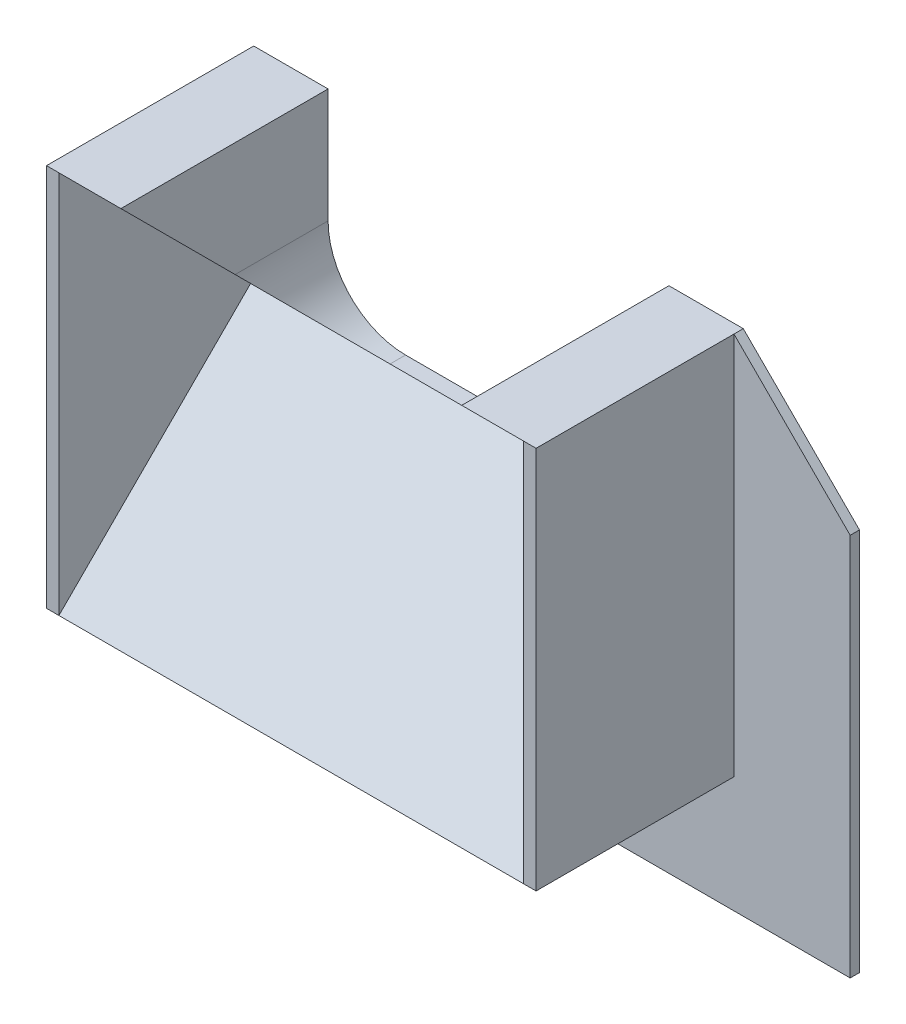
ISO-10303-21;
HEADER;
FILE_DESCRIPTION(('STEP AP214'),'2;1');
FILE_NAME('part.step','',(''),(''),'','','');
FILE_SCHEMA(('AUTOMOTIVE_DESIGN { 1 0 10303 214 1 1 1 1 }'));
ENDSEC;
DATA;
#1=APPLICATION_CONTEXT('core data for automotive mechanical design processes');
#2=APPLICATION_PROTOCOL_DEFINITION('international standard','automotive_design',2000,#1);
#3=PRODUCT_CONTEXT('',#1,'mechanical');
#4=PRODUCT('Part','Part','',(#3));
#5=PRODUCT_RELATED_PRODUCT_CATEGORY('part','',(#4));
#6=PRODUCT_DEFINITION_FORMATION('','',#4);
#7=PRODUCT_DEFINITION_CONTEXT('part definition',#1,'design');
#8=PRODUCT_DEFINITION('design','',#6,#7);
#9=PRODUCT_DEFINITION_SHAPE('','',#8);
#10=(LENGTH_UNIT() NAMED_UNIT(*) SI_UNIT(.MILLI.,.METRE.));
#11=(NAMED_UNIT(*) PLANE_ANGLE_UNIT() SI_UNIT($,.RADIAN.));
#12=(NAMED_UNIT(*) SI_UNIT($,.STERADIAN.) SOLID_ANGLE_UNIT());
#13=UNCERTAINTY_MEASURE_WITH_UNIT(LENGTH_MEASURE(1.E-05),#10,'distance_accuracy_value','');
#14=(GEOMETRIC_REPRESENTATION_CONTEXT(3) GLOBAL_UNCERTAINTY_ASSIGNED_CONTEXT((#13)) GLOBAL_UNIT_ASSIGNED_CONTEXT((#10,
#11,#12)) REPRESENTATION_CONTEXT('',''));
#15=CARTESIAN_POINT('',(0.,0.,0.));
#16=DIRECTION('',(0.,0.,1.));
#17=DIRECTION('',(1.,0.,0.));
#18=AXIS2_PLACEMENT_3D('',#15,#16,#17);
#19=CARTESIAN_POINT('',(60.,-24.7487373415292,24.7487373415292));
#20=DIRECTION('',(0.,1.,0.));
#21=DIRECTION('',(0.,0.,1.));
#22=AXIS2_PLACEMENT_3D('',#19,#20,#21);
#23=PLANE('',#22);
#24=DIRECTION('',(1.,0.,0.));
#25=VECTOR('',#24,1.);
#26=CARTESIAN_POINT('',(61.6,-24.7487373415292,-0.800000000000002));
#27=LINE('',#26,#25);
#28=CARTESIAN_POINT('',(-1.6,-24.7487373415292,-0.800000000000002));
#29=VERTEX_POINT('',#28);
#30=CARTESIAN_POINT('',(61.6,-24.7487373415292,-0.800000000000002));
#31=VERTEX_POINT('',#30);
#32=EDGE_CURVE('E176',#29,#31,#27,.T.);
#33=ORIENTED_EDGE('',*,*,#32,.T.);
#34=DIRECTION('',(0.,0.,1.));
#35=VECTOR('',#34,1.);
#36=CARTESIAN_POINT('',(61.6,-24.7487373415292,24.7487373415292));
#37=LINE('',#36,#35);
#38=CARTESIAN_POINT('',(61.6,-24.7487373415292,24.7487373415292));
#39=VERTEX_POINT('',#38);
#40=EDGE_CURVE('E359',#31,#39,#37,.T.);
#41=ORIENTED_EDGE('',*,*,#40,.T.);
#42=DIRECTION('',(-1.,0.,0.));
#43=VECTOR('',#42,1.);
#44=CARTESIAN_POINT('',(61.6,-24.7487373415292,24.7487373415292));
#45=LINE('',#44,#43);
#46=CARTESIAN_POINT('',(60.,-24.7487373415292,24.7487373415292));
#47=VERTEX_POINT('',#46);
#48=EDGE_CURVE('E216',#39,#47,#45,.T.);
#49=ORIENTED_EDGE('',*,*,#48,.T.);
#50=DIRECTION('',(-1.,0.,0.));
#51=VECTOR('',#50,1.);
#52=CARTESIAN_POINT('',(60.,-24.7487373415292,24.7487373415292));
#53=LINE('',#52,#51);
#54=CARTESIAN_POINT('',(0.,-24.7487373415292,24.7487373415292));
#55=VERTEX_POINT('',#54);
#56=EDGE_CURVE('E266',#47,#55,#53,.T.);
#57=ORIENTED_EDGE('',*,*,#56,.T.);
#58=DIRECTION('',(1.,0.,0.));
#59=VECTOR('',#58,1.);
#60=CARTESIAN_POINT('',(-1.6,-24.7487373415292,24.7487373415292));
#61=LINE('',#60,#59);
#62=CARTESIAN_POINT('',(-1.6,-24.7487373415292,24.7487373415292));
#63=VERTEX_POINT('',#62);
#64=EDGE_CURVE('E201',#63,#55,#61,.T.);
#65=ORIENTED_EDGE('',*,*,#64,.F.);
#66=DIRECTION('',(0.,0.,1.));
#67=VECTOR('',#66,1.);
#68=CARTESIAN_POINT('',(-1.6,-24.7487373415292,24.7487373415292));
#69=LINE('',#68,#67);
#70=EDGE_CURVE('E194',#29,#63,#69,.T.);
#71=ORIENTED_EDGE('',*,*,#70,.F.);
#72=EDGE_LOOP('',(#33,#41,#49,#57,#65,#71));
#73=FACE_BOUND('',#72,.T.);
#74=ADVANCED_FACE('F39',(#73),#23,.F.);
#75=CARTESIAN_POINT('',(-1.6,0.,0.));
#76=DIRECTION('',(1.,0.,0.));
#77=DIRECTION('',(0.,0.,-1.));
#78=AXIS2_PLACEMENT_3D('',#75,#76,#77);
#79=PLANE('',#78);
#80=DIRECTION('',(0.,-1.,0.));
#81=VECTOR('',#80,1.);
#82=CARTESIAN_POINT('',(-1.6,-24.7487373415292,-0.800000000000002));
#83=LINE('',#82,#81);
#84=CARTESIAN_POINT('',(-1.6,24.7487373415292,-0.800000000000002));
#85=VERTEX_POINT('',#84);
#86=EDGE_CURVE('E180',#85,#29,#83,.T.);
#87=ORIENTED_EDGE('',*,*,#86,.T.);
#88=ORIENTED_EDGE('',*,*,#70,.T.);
#89=DIRECTION('',(0.,1.,0.));
#90=VECTOR('',#89,1.);
#91=CARTESIAN_POINT('',(-1.6,24.7487373415292,24.7487373415292));
#92=LINE('',#91,#90);
#93=CARTESIAN_POINT('',(-1.6,24.7487373415292,24.7487373415292));
#94=VERTEX_POINT('',#93);
#95=EDGE_CURVE('E209',#63,#94,#92,.T.);
#96=ORIENTED_EDGE('',*,*,#95,.T.);
#97=DIRECTION('',(0.,0.,-1.));
#98=VECTOR('',#97,1.);
#99=CARTESIAN_POINT('',(-1.6,24.7487373415292,24.7487373415292));
#100=LINE('',#99,#98);
#101=EDGE_CURVE('E196',#94,#85,#100,.T.);
#102=ORIENTED_EDGE('',*,*,#101,.T.);
#103=EDGE_LOOP('',(#87,#88,#96,#102));
#104=FACE_BOUND('',#103,.T.);
#105=ADVANCED_FACE('F192',(#104),#79,.F.);
#106=CARTESIAN_POINT('',(61.6,0.,0.));
#107=DIRECTION('',(-1.,0.,0.));
#108=DIRECTION('',(0.,0.,-1.));
#109=AXIS2_PLACEMENT_3D('',#106,#107,#108);
#110=PLANE('',#109);
#111=DIRECTION('',(0.,1.,0.));
#112=VECTOR('',#111,1.);
#113=CARTESIAN_POINT('',(61.6,24.7487373415292,-0.800000000000002));
#114=LINE('',#113,#112);
#115=CARTESIAN_POINT('',(61.6,24.7487373415292,-0.800000000000002));
#116=VERTEX_POINT('',#115);
#117=EDGE_CURVE('E184',#31,#116,#114,.T.);
#118=ORIENTED_EDGE('',*,*,#117,.T.);
#119=DIRECTION('',(0.,0.,-1.));
#120=VECTOR('',#119,1.);
#121=CARTESIAN_POINT('',(61.6,24.7487373415292,24.7487373415292));
#122=LINE('',#121,#120);
#123=CARTESIAN_POINT('',(61.6,24.7487373415292,24.7487373415292));
#124=VERTEX_POINT('',#123);
#125=EDGE_CURVE('E362',#124,#116,#122,.T.);
#126=ORIENTED_EDGE('',*,*,#125,.F.);
#127=DIRECTION('',(0.,1.,0.));
#128=VECTOR('',#127,1.);
#129=CARTESIAN_POINT('',(61.6,24.7487373415292,24.7487373415292));
#130=LINE('',#129,#128);
#131=EDGE_CURVE('E355',#39,#124,#130,.T.);
#132=ORIENTED_EDGE('',*,*,#131,.F.);
#133=ORIENTED_EDGE('',*,*,#40,.F.);
#134=EDGE_LOOP('',(#118,#126,#132,#133));
#135=FACE_BOUND('',#134,.T.);
#136=ADVANCED_FACE('F413',(#135),#110,.F.);
#137=CARTESIAN_POINT('',(60.,24.7487373415292,-2.));
#138=DIRECTION('',(0.,-1.,0.));
#139=DIRECTION('',(0.,0.,-1.));
#140=AXIS2_PLACEMENT_3D('',#137,#138,#139);
#141=PLANE('',#140);
#142=DIRECTION('',(-1.,0.,0.));
#143=VECTOR('',#142,1.);
#144=CARTESIAN_POINT('',(60.,24.7487373415292,24.7487373415292));
#145=LINE('',#144,#143);
#146=CARTESIAN_POINT('',(8.,24.7487373415292,24.7487373415292));
#147=VERTEX_POINT('',#146);
#148=CARTESIAN_POINT('',(0.,24.7487373415292,24.7487373415292));
#149=VERTEX_POINT('',#148);
#150=EDGE_CURVE('E271',#147,#149,#145,.T.);
#151=ORIENTED_EDGE('',*,*,#150,.F.);
#152=DIRECTION('',(0.,0.,-1.));
#153=VECTOR('',#152,1.);
#154=CARTESIAN_POINT('',(8.,24.7487373415292,24.7487373415292));
#155=LINE('',#154,#153);
#156=CARTESIAN_POINT('',(8.,24.7487373415292,-2.));
#157=VERTEX_POINT('',#156);
#158=EDGE_CURVE('E230',#147,#157,#155,.T.);
#159=ORIENTED_EDGE('',*,*,#158,.T.);
#160=DIRECTION('',(-1.,0.,0.));
#161=VECTOR('',#160,1.);
#162=CARTESIAN_POINT('',(60.,24.7487373415292,-2.));
#163=LINE('',#162,#161);
#164=CARTESIAN_POINT('',(-1.6,24.7487373415292,-2.));
#165=VERTEX_POINT('',#164);
#166=EDGE_CURVE('E256',#157,#165,#163,.T.);
#167=ORIENTED_EDGE('',*,*,#166,.T.);
#168=DIRECTION('',(0.,0.,-1.));
#169=VECTOR('',#168,1.);
#170=CARTESIAN_POINT('',(-1.6,24.7487373415292,-0.800000000000002));
#171=LINE('',#170,#169);
#172=EDGE_CURVE('E337',#85,#165,#171,.T.);
#173=ORIENTED_EDGE('',*,*,#172,.F.);
#174=ORIENTED_EDGE('',*,*,#101,.F.);
#175=DIRECTION('',(1.,0.,0.));
#176=VECTOR('',#175,1.);
#177=CARTESIAN_POINT('',(-1.6,24.7487373415292,24.7487373415292));
#178=LINE('',#177,#176);
#179=EDGE_CURVE('E207',#94,#149,#178,.T.);
#180=ORIENTED_EDGE('',*,*,#179,.T.);
#181=EDGE_LOOP('',(#151,#159,#167,#173,#174,#180));
#182=FACE_BOUND('',#181,.T.);
#183=ADVANCED_FACE('F381',(#182),#141,.F.);
#184=CARTESIAN_POINT('',(60.,24.7487373415292,24.7487373415292));
#185=DIRECTION('',(0.,0.707106781186548,-0.707106781186547));
#186=DIRECTION('',(0.,0.707106781186547,0.707106781186548));
#187=AXIS2_PLACEMENT_3D('',#184,#185,#186);
#188=PLANE('',#187);
#189=DIRECTION('',(-1.,0.,0.));
#190=VECTOR('',#189,1.);
#191=CARTESIAN_POINT('',(60.,0.,0.));
#192=LINE('',#191,#190);
#193=CARTESIAN_POINT('',(18.,0.,0.));
#194=VERTEX_POINT('',#193);
#195=CARTESIAN_POINT('',(0.,0.,0.));
#196=VERTEX_POINT('',#195);
#197=EDGE_CURVE('E76',#194,#196,#192,.T.);
#198=ORIENTED_EDGE('',*,*,#197,.F.);
#199=CARTESIAN_POINT('',(18.,9.99999999999999,9.99999999999999));
#200=DIRECTION('',(0.,0.707106781186548,-0.707106781186547));
#201=DIRECTION('',(0.,0.707106781186547,0.707106781186548));
#202=AXIS2_PLACEMENT_3D('',#199,#200,#201);
#203=ELLIPSE('',#202,14.142135623731,10.);
#204=CARTESIAN_POINT('',(8.,9.99999999999999,9.99999999999999));
#205=VERTEX_POINT('',#204);
#206=EDGE_CURVE('E291',#194,#205,#203,.T.);
#207=ORIENTED_EDGE('',*,*,#206,.T.);
#208=DIRECTION('',(0.,0.707106781186547,0.707106781186548));
#209=VECTOR('',#208,1.);
#210=CARTESIAN_POINT('',(8.,24.7487373415292,24.7487373415292));
#211=LINE('',#210,#209);
#212=EDGE_CURVE('E243',#205,#147,#211,.T.);
#213=ORIENTED_EDGE('',*,*,#212,.T.);
#214=ORIENTED_EDGE('',*,*,#150,.T.);
#215=DIRECTION('',(0.,-0.707106781186547,-0.707106781186548));
#216=VECTOR('',#215,1.);
#217=CARTESIAN_POINT('',(0.,24.7487373415292,24.7487373415292));
#218=LINE('',#217,#216);
#219=EDGE_CURVE('E246',#149,#196,#218,.T.);
#220=ORIENTED_EDGE('',*,*,#219,.T.);
#221=EDGE_LOOP('',(#198,#207,#213,#214,#220));
#222=FACE_BOUND('',#221,.T.);
#223=ADVANCED_FACE('F444',(#222),#188,.F.);
#224=CARTESIAN_POINT('',(61.6,24.7487373415292,-2.));
#225=VERTEX_POINT('',#224);
#226=CARTESIAN_POINT('',(52.,24.7487373415292,-2.));
#227=VERTEX_POINT('',#226);
#228=EDGE_CURVE('E262',#225,#227,#163,.T.);
#229=ORIENTED_EDGE('',*,*,#228,.T.);
#230=DIRECTION('',(0.,0.,-1.));
#231=VECTOR('',#230,1.);
#232=CARTESIAN_POINT('',(52.,24.7487373415292,24.7487373415292));
#233=LINE('',#232,#231);
#234=CARTESIAN_POINT('',(52.,24.7487373415292,24.7487373415292));
#235=VERTEX_POINT('',#234);
#236=EDGE_CURVE('E231',#235,#227,#233,.T.);
#237=ORIENTED_EDGE('',*,*,#236,.F.);
#238=CARTESIAN_POINT('',(60.,24.7487373415292,24.7487373415292));
#239=VERTEX_POINT('',#238);
#240=EDGE_CURVE('E272',#239,#235,#145,.T.);
#241=ORIENTED_EDGE('',*,*,#240,.F.);
#242=DIRECTION('',(-1.,0.,0.));
#243=VECTOR('',#242,1.);
#244=CARTESIAN_POINT('',(61.6,24.7487373415292,24.7487373415292));
#245=LINE('',#244,#243);
#246=EDGE_CURVE('E365',#124,#239,#245,.T.);
#247=ORIENTED_EDGE('',*,*,#246,.F.);
#248=ORIENTED_EDGE('',*,*,#125,.T.);
#249=DIRECTION('',(0.,0.,-1.));
#250=VECTOR('',#249,1.);
#251=CARTESIAN_POINT('',(61.6,24.7487373415292,-0.800000000000002));
#252=LINE('',#251,#250);
#253=EDGE_CURVE('E311',#116,#225,#252,.T.);
#254=ORIENTED_EDGE('',*,*,#253,.T.);
#255=EDGE_LOOP('',(#229,#237,#241,#247,#248,#254));
#256=FACE_BOUND('',#255,.T.);
#257=ADVANCED_FACE('F307',(#256),#141,.F.);
#258=ORIENTED_EDGE('',*,*,#240,.T.);
#259=DIRECTION('',(0.,-0.707106781186547,-0.707106781186548));
#260=VECTOR('',#259,1.);
#261=CARTESIAN_POINT('',(52.,24.7487373415292,24.7487373415292));
#262=LINE('',#261,#260);
#263=CARTESIAN_POINT('',(52.,9.99999999999999,9.99999999999999));
#264=VERTEX_POINT('',#263);
#265=EDGE_CURVE('E234',#235,#264,#262,.T.);
#266=ORIENTED_EDGE('',*,*,#265,.T.);
#267=CARTESIAN_POINT('',(42.,9.99999999999999,9.99999999999999));
#268=DIRECTION('',(0.,0.707106781186548,-0.707106781186547));
#269=DIRECTION('',(0.,0.707106781186547,0.707106781186548));
#270=AXIS2_PLACEMENT_3D('',#267,#268,#269);
#271=ELLIPSE('',#270,14.142135623731,10.);
#272=CARTESIAN_POINT('',(42.,0.,0.));
#273=VERTEX_POINT('',#272);
#274=EDGE_CURVE('E11',#264,#273,#271,.T.);
#275=ORIENTED_EDGE('',*,*,#274,.T.);
#276=CARTESIAN_POINT('',(60.,0.,0.));
#277=VERTEX_POINT('',#276);
#278=EDGE_CURVE('E55',#277,#273,#192,.T.);
#279=ORIENTED_EDGE('',*,*,#278,.F.);
#280=DIRECTION('',(0.,-0.707106781186547,-0.707106781186548));
#281=VECTOR('',#280,1.);
#282=CARTESIAN_POINT('',(60.,24.7487373415292,24.7487373415292));
#283=LINE('',#282,#281);
#284=EDGE_CURVE('E247',#239,#277,#283,.T.);
#285=ORIENTED_EDGE('',*,*,#284,.F.);
#286=EDGE_LOOP('',(#258,#266,#275,#279,#285));
#287=FACE_BOUND('',#286,.T.);
#288=ADVANCED_FACE('F304',(#287),#188,.F.);
#289=CARTESIAN_POINT('',(60.,0.,0.));
#290=DIRECTION('',(0.,-0.707106781186548,-0.707106781186547));
#291=DIRECTION('',(0.,0.707106781186547,-0.707106781186548));
#292=AXIS2_PLACEMENT_3D('',#289,#290,#291);
#293=PLANE('',#292);
#294=DIRECTION('',(0.,-0.707106781186547,0.707106781186548));
#295=VECTOR('',#294,1.);
#296=CARTESIAN_POINT('',(0.,0.,0.));
#297=LINE('',#296,#295);
#298=EDGE_CURVE('E252',#196,#55,#297,.T.);
#299=ORIENTED_EDGE('',*,*,#298,.T.);
#300=ORIENTED_EDGE('',*,*,#56,.F.);
#301=DIRECTION('',(0.,-0.707106781186547,0.707106781186548));
#302=VECTOR('',#301,1.);
#303=CARTESIAN_POINT('',(60.,0.,0.));
#304=LINE('',#303,#302);
#305=EDGE_CURVE('E251',#277,#47,#304,.T.);
#306=ORIENTED_EDGE('',*,*,#305,.F.);
#307=ORIENTED_EDGE('',*,*,#278,.T.);
#308=DIRECTION('',(-1.,0.,0.));
#309=VECTOR('',#308,1.);
#310=CARTESIAN_POINT('',(60.,0.,0.));
#311=LINE('',#310,#309);
#312=EDGE_CURVE('E240',#273,#194,#311,.T.);
#313=ORIENTED_EDGE('',*,*,#312,.T.);
#314=ORIENTED_EDGE('',*,*,#197,.T.);
#315=EDGE_LOOP('',(#299,#300,#306,#307,#313,#314));
#316=FACE_BOUND('',#315,.T.);
#317=ADVANCED_FACE('F419',(#316),#293,.F.);
#318=CARTESIAN_POINT('',(60.,-24.7487373415292,-2.));
#319=DIRECTION('',(0.,0.,1.));
#320=DIRECTION('',(1.,0.,0.));
#321=AXIS2_PLACEMENT_3D('',#318,#319,#320);
#322=PLANE('',#321);
#323=ORIENTED_EDGE('',*,*,#166,.F.);
#324=DIRECTION('',(0.,1.,0.));
#325=VECTOR('',#324,1.);
#326=CARTESIAN_POINT('',(8.,0.,-2.));
#327=LINE('',#326,#325);
#328=CARTESIAN_POINT('',(8.,9.99999999999999,-2.));
#329=VERTEX_POINT('',#328);
#330=EDGE_CURVE('E221',#329,#157,#327,.T.);
#331=ORIENTED_EDGE('',*,*,#330,.F.);
#332=CARTESIAN_POINT('',(18.,9.99999999999999,-2.));
#333=DIRECTION('',(0.,0.,1.));
#334=DIRECTION('',(1.,0.,0.));
#335=AXIS2_PLACEMENT_3D('',#332,#333,#334);
#336=CIRCLE('',#335,10.);
#337=CARTESIAN_POINT('',(18.,0.,-2.));
#338=VERTEX_POINT('',#337);
#339=EDGE_CURVE('E84',#329,#338,#336,.T.);
#340=ORIENTED_EDGE('',*,*,#339,.T.);
#341=DIRECTION('',(-1.,0.,0.));
#342=VECTOR('',#341,1.);
#343=CARTESIAN_POINT('',(52.,0.,-2.));
#344=LINE('',#343,#342);
#345=CARTESIAN_POINT('',(42.,0.,-2.));
#346=VERTEX_POINT('',#345);
#347=EDGE_CURVE('E227',#346,#338,#344,.T.);
#348=ORIENTED_EDGE('',*,*,#347,.F.);
#349=CARTESIAN_POINT('',(42.,9.99999999999999,-2.));
#350=DIRECTION('',(0.,0.,1.));
#351=DIRECTION('',(1.,0.,0.));
#352=AXIS2_PLACEMENT_3D('',#349,#350,#351);
#353=CIRCLE('',#352,10.);
#354=CARTESIAN_POINT('',(52.,9.99999999999999,-2.));
#355=VERTEX_POINT('',#354);
#356=EDGE_CURVE('E48',#346,#355,#353,.T.);
#357=ORIENTED_EDGE('',*,*,#356,.T.);
#358=DIRECTION('',(0.,-1.,0.));
#359=VECTOR('',#358,1.);
#360=CARTESIAN_POINT('',(52.,0.,-2.));
#361=LINE('',#360,#359);
#362=EDGE_CURVE('E224',#227,#355,#361,.T.);
#363=ORIENTED_EDGE('',*,*,#362,.F.);
#364=ORIENTED_EDGE('',*,*,#228,.F.);
#365=DIRECTION('',(0.707106781186548,-0.707106781186547,0.));
#366=VECTOR('',#365,1.);
#367=CARTESIAN_POINT('',(76.6,9.74873734152916,-2.));
#368=LINE('',#367,#366);
#369=CARTESIAN_POINT('',(76.6,9.74873734152916,-2.));
#370=VERTEX_POINT('',#369);
#371=EDGE_CURVE('E314',#225,#370,#368,.T.);
#372=ORIENTED_EDGE('',*,*,#371,.T.);
#373=DIRECTION('',(0.,-1.,0.));
#374=VECTOR('',#373,1.);
#375=CARTESIAN_POINT('',(76.6,-39.7487373415292,-2.));
#376=LINE('',#375,#374);
#377=CARTESIAN_POINT('',(76.6,-39.7487373415292,-2.));
#378=VERTEX_POINT('',#377);
#379=EDGE_CURVE('E317',#370,#378,#376,.T.);
#380=ORIENTED_EDGE('',*,*,#379,.T.);
#381=DIRECTION('',(-1.,0.,0.));
#382=VECTOR('',#381,1.);
#383=CARTESIAN_POINT('',(-16.6,-39.7487373415292,-2.));
#384=LINE('',#383,#382);
#385=CARTESIAN_POINT('',(-16.6,-39.7487373415292,-2.));
#386=VERTEX_POINT('',#385);
#387=EDGE_CURVE('E322',#378,#386,#384,.T.);
#388=ORIENTED_EDGE('',*,*,#387,.T.);
#389=DIRECTION('',(0.,1.,0.));
#390=VECTOR('',#389,1.);
#391=CARTESIAN_POINT('',(-16.6,9.74873734152916,-2.));
#392=LINE('',#391,#390);
#393=CARTESIAN_POINT('',(-16.6,9.74873734152916,-2.));
#394=VERTEX_POINT('',#393);
#395=EDGE_CURVE('E330',#386,#394,#392,.T.);
#396=ORIENTED_EDGE('',*,*,#395,.T.);
#397=DIRECTION('',(0.707106781186547,0.707106781186547,0.));
#398=VECTOR('',#397,1.);
#399=CARTESIAN_POINT('',(-1.6,24.7487373415292,-2.));
#400=LINE('',#399,#398);
#401=EDGE_CURVE('E198',#394,#165,#400,.T.);
#402=ORIENTED_EDGE('',*,*,#401,.T.);
#403=EDGE_LOOP('',(#323,#331,#340,#348,#357,#363,#364,#372,#380,#388,#396,#402));
#404=FACE_BOUND('',#403,.T.);
#405=ADVANCED_FACE('F296',(#404),#322,.F.);
#406=CARTESIAN_POINT('',(8.,0.,24.7487373415292));
#407=DIRECTION('',(-1.,0.,0.));
#408=DIRECTION('',(0.,0.,1.));
#409=AXIS2_PLACEMENT_3D('',#406,#407,#408);
#410=PLANE('',#409);
#411=ORIENTED_EDGE('',*,*,#212,.F.);
#412=DIRECTION('',(0.,0.,-1.));
#413=VECTOR('',#412,1.);
#414=CARTESIAN_POINT('',(8.,9.99999999999999,-2.));
#415=LINE('',#414,#413);
#416=EDGE_CURVE('E276',#205,#329,#415,.T.);
#417=ORIENTED_EDGE('',*,*,#416,.T.);
#418=ORIENTED_EDGE('',*,*,#330,.T.);
#419=ORIENTED_EDGE('',*,*,#158,.F.);
#420=EDGE_LOOP('',(#411,#417,#418,#419));
#421=FACE_BOUND('',#420,.T.);
#422=ADVANCED_FACE('F462',(#421),#410,.F.);
#423=CARTESIAN_POINT('',(52.,0.,24.7487373415292));
#424=DIRECTION('',(0.,-1.,0.));
#425=DIRECTION('',(1.,0.,0.));
#426=AXIS2_PLACEMENT_3D('',#423,#424,#425);
#427=PLANE('',#426);
#428=ORIENTED_EDGE('',*,*,#347,.T.);
#429=DIRECTION('',(0.,0.,-1.));
#430=VECTOR('',#429,1.);
#431=CARTESIAN_POINT('',(18.,0.,0.));
#432=LINE('',#431,#430);
#433=EDGE_CURVE('E284',#338,#194,#432,.F.);
#434=ORIENTED_EDGE('',*,*,#433,.T.);
#435=ORIENTED_EDGE('',*,*,#312,.F.);
#436=DIRECTION('',(0.,0.,-1.));
#437=VECTOR('',#436,1.);
#438=CARTESIAN_POINT('',(42.,0.,-2.));
#439=LINE('',#438,#437);
#440=EDGE_CURVE('E280',#273,#346,#439,.T.);
#441=ORIENTED_EDGE('',*,*,#440,.T.);
#442=EDGE_LOOP('',(#428,#434,#435,#441));
#443=FACE_BOUND('',#442,.T.);
#444=ADVANCED_FACE('F454',(#443),#427,.F.);
#445=CARTESIAN_POINT('',(52.,0.,24.7487373415292));
#446=DIRECTION('',(1.,0.,0.));
#447=DIRECTION('',(0.,1.,0.));
#448=AXIS2_PLACEMENT_3D('',#445,#446,#447);
#449=PLANE('',#448);
#450=ORIENTED_EDGE('',*,*,#362,.T.);
#451=DIRECTION('',(0.,0.,-1.));
#452=VECTOR('',#451,1.);
#453=CARTESIAN_POINT('',(52.,9.99999999999999,0.));
#454=LINE('',#453,#452);
#455=EDGE_CURVE('E64',#355,#264,#454,.F.);
#456=ORIENTED_EDGE('',*,*,#455,.T.);
#457=ORIENTED_EDGE('',*,*,#265,.F.);
#458=ORIENTED_EDGE('',*,*,#236,.T.);
#459=EDGE_LOOP('',(#450,#456,#457,#458));
#460=FACE_BOUND('',#459,.T.);
#461=ADVANCED_FACE('F300',(#460),#449,.F.);
#462=CARTESIAN_POINT('',(18.,9.99999999999999,24.7487373415292));
#463=DIRECTION('',(0.,0.,1.));
#464=DIRECTION('',(1.,0.,0.));
#465=AXIS2_PLACEMENT_3D('',#462,#463,#464);
#466=CYLINDRICAL_SURFACE('',#465,10.);
#467=ORIENTED_EDGE('',*,*,#206,.F.);
#468=ORIENTED_EDGE('',*,*,#433,.F.);
#469=ORIENTED_EDGE('',*,*,#339,.F.);
#470=ORIENTED_EDGE('',*,*,#416,.F.);
#471=EDGE_LOOP('',(#467,#468,#469,#470));
#472=FACE_BOUND('',#471,.T.);
#473=ADVANCED_FACE('F446',(#472),#466,.F.);
#474=CARTESIAN_POINT('',(42.,9.99999999999999,24.7487373415292));
#475=DIRECTION('',(0.,0.,1.));
#476=DIRECTION('',(1.,0.,0.));
#477=AXIS2_PLACEMENT_3D('',#474,#475,#476);
#478=CYLINDRICAL_SURFACE('',#477,10.);
#479=ORIENTED_EDGE('',*,*,#274,.F.);
#480=ORIENTED_EDGE('',*,*,#455,.F.);
#481=ORIENTED_EDGE('',*,*,#356,.F.);
#482=ORIENTED_EDGE('',*,*,#440,.F.);
#483=EDGE_LOOP('',(#479,#480,#481,#482));
#484=FACE_BOUND('',#483,.T.);
#485=ADVANCED_FACE('F41',(#484),#478,.F.);
#486=CARTESIAN_POINT('',(0.,0.,0.));
#487=DIRECTION('',(1.,0.,0.));
#488=DIRECTION('',(0.,0.,-1.));
#489=AXIS2_PLACEMENT_3D('',#486,#487,#488);
#490=PLANE('',#489);
#491=ORIENTED_EDGE('',*,*,#298,.F.);
#492=ORIENTED_EDGE('',*,*,#219,.F.);
#493=DIRECTION('',(0.,1.,0.));
#494=VECTOR('',#493,1.);
#495=CARTESIAN_POINT('',(0.,24.7487373415292,24.7487373415292));
#496=LINE('',#495,#494);
#497=EDGE_CURVE('E213',#55,#149,#496,.T.);
#498=ORIENTED_EDGE('',*,*,#497,.F.);
#499=EDGE_LOOP('',(#491,#492,#498));
#500=FACE_BOUND('',#499,.T.);
#501=ADVANCED_FACE('F453',(#500),#490,.T.);
#502=CARTESIAN_POINT('',(-1.6,24.7487373415292,24.7487373415292));
#503=DIRECTION('',(0.,0.,-1.));
#504=DIRECTION('',(-1.,0.,0.));
#505=AXIS2_PLACEMENT_3D('',#502,#503,#504);
#506=PLANE('',#505);
#507=ORIENTED_EDGE('',*,*,#497,.T.);
#508=ORIENTED_EDGE('',*,*,#179,.F.);
#509=ORIENTED_EDGE('',*,*,#95,.F.);
#510=ORIENTED_EDGE('',*,*,#64,.T.);
#511=EDGE_LOOP('',(#507,#508,#509,#510));
#512=FACE_BOUND('',#511,.T.);
#513=ADVANCED_FACE('F376',(#512),#506,.F.);
#514=CARTESIAN_POINT('',(61.6,24.7487373415292,24.7487373415292));
#515=DIRECTION('',(0.,0.,1.));
#516=DIRECTION('',(1.,0.,0.));
#517=AXIS2_PLACEMENT_3D('',#514,#515,#516);
#518=PLANE('',#517);
#519=DIRECTION('',(0.,1.,0.));
#520=VECTOR('',#519,1.);
#521=CARTESIAN_POINT('',(60.,24.7487373415292,24.7487373415292));
#522=LINE('',#521,#520);
#523=EDGE_CURVE('E340',#47,#239,#522,.T.);
#524=ORIENTED_EDGE('',*,*,#523,.F.);
#525=ORIENTED_EDGE('',*,*,#48,.F.);
#526=ORIENTED_EDGE('',*,*,#131,.T.);
#527=ORIENTED_EDGE('',*,*,#246,.T.);
#528=EDGE_LOOP('',(#524,#525,#526,#527));
#529=FACE_BOUND('',#528,.T.);
#530=ADVANCED_FACE('F418',(#529),#518,.T.);
#531=CARTESIAN_POINT('',(60.,0.,0.));
#532=DIRECTION('',(-1.,0.,0.));
#533=DIRECTION('',(0.,0.,-1.));
#534=AXIS2_PLACEMENT_3D('',#531,#532,#533);
#535=PLANE('',#534);
#536=ORIENTED_EDGE('',*,*,#523,.T.);
#537=ORIENTED_EDGE('',*,*,#284,.T.);
#538=ORIENTED_EDGE('',*,*,#305,.T.);
#539=EDGE_LOOP('',(#536,#537,#538));
#540=FACE_BOUND('',#539,.T.);
#541=ADVANCED_FACE('F421',(#540),#535,.T.);
#542=CARTESIAN_POINT('',(-1.6,24.7487373415292,-0.800000000000002));
#543=DIRECTION('',(-0.707106781186547,0.707106781186547,0.));
#544=DIRECTION('',(-0.707106781186548,-0.707106781186548,0.));
#545=AXIS2_PLACEMENT_3D('',#542,#543,#544);
#546=PLANE('',#545);
#547=ORIENTED_EDGE('',*,*,#401,.F.);
#548=DIRECTION('',(0.,0.,-1.));
#549=VECTOR('',#548,1.);
#550=CARTESIAN_POINT('',(-16.6,9.74873734152916,-0.800000000000002));
#551=LINE('',#550,#549);
#552=CARTESIAN_POINT('',(-16.6,9.74873734152916,-0.800000000000002));
#553=VERTEX_POINT('',#552);
#554=EDGE_CURVE('E341',#553,#394,#551,.T.);
#555=ORIENTED_EDGE('',*,*,#554,.F.);
#556=DIRECTION('',(0.707106781186547,0.707106781186547,0.));
#557=VECTOR('',#556,1.);
#558=CARTESIAN_POINT('',(-1.6,24.7487373415292,-0.800000000000002));
#559=LINE('',#558,#557);
#560=EDGE_CURVE('E325',#553,#85,#559,.T.);
#561=ORIENTED_EDGE('',*,*,#560,.T.);
#562=ORIENTED_EDGE('',*,*,#172,.T.);
#563=EDGE_LOOP('',(#547,#555,#561,#562));
#564=FACE_BOUND('',#563,.T.);
#565=ADVANCED_FACE('F386',(#564),#546,.T.);
#566=CARTESIAN_POINT('',(-16.6,9.74873734152916,-0.800000000000002));
#567=DIRECTION('',(-1.,0.,0.));
#568=DIRECTION('',(0.,0.,1.));
#569=AXIS2_PLACEMENT_3D('',#566,#567,#568);
#570=PLANE('',#569);
#571=ORIENTED_EDGE('',*,*,#395,.F.);
#572=DIRECTION('',(0.,0.,-1.));
#573=VECTOR('',#572,1.);
#574=CARTESIAN_POINT('',(-16.6,-39.7487373415292,-0.800000000000002));
#575=LINE('',#574,#573);
#576=CARTESIAN_POINT('',(-16.6,-39.7487373415292,-0.800000000000002));
#577=VERTEX_POINT('',#576);
#578=EDGE_CURVE('E344',#577,#386,#575,.T.);
#579=ORIENTED_EDGE('',*,*,#578,.F.);
#580=DIRECTION('',(0.,1.,0.));
#581=VECTOR('',#580,1.);
#582=CARTESIAN_POINT('',(-16.6,9.74873734152916,-0.800000000000002));
#583=LINE('',#582,#581);
#584=EDGE_CURVE('E393',#577,#553,#583,.T.);
#585=ORIENTED_EDGE('',*,*,#584,.T.);
#586=ORIENTED_EDGE('',*,*,#554,.T.);
#587=EDGE_LOOP('',(#571,#579,#585,#586));
#588=FACE_BOUND('',#587,.T.);
#589=ADVANCED_FACE('F390',(#588),#570,.T.);
#590=CARTESIAN_POINT('',(-16.6,-39.7487373415292,-0.800000000000002));
#591=DIRECTION('',(0.,-1.,0.));
#592=DIRECTION('',(0.,0.,-1.));
#593=AXIS2_PLACEMENT_3D('',#590,#591,#592);
#594=PLANE('',#593);
#595=ORIENTED_EDGE('',*,*,#387,.F.);
#596=DIRECTION('',(0.,0.,-1.));
#597=VECTOR('',#596,1.);
#598=CARTESIAN_POINT('',(76.6,-39.7487373415292,-0.800000000000002));
#599=LINE('',#598,#597);
#600=CARTESIAN_POINT('',(76.6,-39.7487373415292,-0.800000000000002));
#601=VERTEX_POINT('',#600);
#602=EDGE_CURVE('E347',#601,#378,#599,.T.);
#603=ORIENTED_EDGE('',*,*,#602,.F.);
#604=DIRECTION('',(-1.,0.,0.));
#605=VECTOR('',#604,1.);
#606=CARTESIAN_POINT('',(-16.6,-39.7487373415292,-0.800000000000002));
#607=LINE('',#606,#605);
#608=EDGE_CURVE('E397',#601,#577,#607,.T.);
#609=ORIENTED_EDGE('',*,*,#608,.T.);
#610=ORIENTED_EDGE('',*,*,#578,.T.);
#611=EDGE_LOOP('',(#595,#603,#609,#610));
#612=FACE_BOUND('',#611,.T.);
#613=ADVANCED_FACE('F558',(#612),#594,.T.);
#614=CARTESIAN_POINT('',(76.6,-39.7487373415292,-0.800000000000002));
#615=DIRECTION('',(1.,0.,0.));
#616=DIRECTION('',(0.,0.,-1.));
#617=AXIS2_PLACEMENT_3D('',#614,#615,#616);
#618=PLANE('',#617);
#619=ORIENTED_EDGE('',*,*,#379,.F.);
#620=DIRECTION('',(0.,0.,-1.));
#621=VECTOR('',#620,1.);
#622=CARTESIAN_POINT('',(76.6,9.74873734152916,-0.800000000000002));
#623=LINE('',#622,#621);
#624=CARTESIAN_POINT('',(76.6,9.74873734152916,-0.800000000000002));
#625=VERTEX_POINT('',#624);
#626=EDGE_CURVE('E350',#625,#370,#623,.T.);
#627=ORIENTED_EDGE('',*,*,#626,.F.);
#628=DIRECTION('',(0.,-1.,0.));
#629=VECTOR('',#628,1.);
#630=CARTESIAN_POINT('',(76.6,-39.7487373415292,-0.800000000000002));
#631=LINE('',#630,#629);
#632=EDGE_CURVE('E401',#625,#601,#631,.T.);
#633=ORIENTED_EDGE('',*,*,#632,.T.);
#634=ORIENTED_EDGE('',*,*,#602,.T.);
#635=EDGE_LOOP('',(#619,#627,#633,#634));
#636=FACE_BOUND('',#635,.T.);
#637=ADVANCED_FACE('F567',(#636),#618,.T.);
#638=CARTESIAN_POINT('',(76.6,9.74873734152916,-0.800000000000002));
#639=DIRECTION('',(0.707106781186547,0.707106781186548,0.));
#640=DIRECTION('',(-0.707106781186548,0.707106781186547,0.));
#641=AXIS2_PLACEMENT_3D('',#638,#639,#640);
#642=PLANE('',#641);
#643=ORIENTED_EDGE('',*,*,#371,.F.);
#644=ORIENTED_EDGE('',*,*,#253,.F.);
#645=DIRECTION('',(0.707106781186548,-0.707106781186547,0.));
#646=VECTOR('',#645,1.);
#647=CARTESIAN_POINT('',(76.6,9.74873734152916,-0.800000000000002));
#648=LINE('',#647,#646);
#649=EDGE_CURVE('E405',#116,#625,#648,.T.);
#650=ORIENTED_EDGE('',*,*,#649,.T.);
#651=ORIENTED_EDGE('',*,*,#626,.T.);
#652=EDGE_LOOP('',(#643,#644,#650,#651));
#653=FACE_BOUND('',#652,.T.);
#654=ADVANCED_FACE('F577',(#653),#642,.T.);
#655=CARTESIAN_POINT('',(0.,0.,-0.800000000000002));
#656=DIRECTION('',(0.,0.,-1.));
#657=DIRECTION('',(-1.,0.,0.));
#658=AXIS2_PLACEMENT_3D('',#655,#656,#657);
#659=PLANE('',#658);
#660=ORIENTED_EDGE('',*,*,#86,.F.);
#661=ORIENTED_EDGE('',*,*,#560,.F.);
#662=ORIENTED_EDGE('',*,*,#584,.F.);
#663=ORIENTED_EDGE('',*,*,#608,.F.);
#664=ORIENTED_EDGE('',*,*,#632,.F.);
#665=ORIENTED_EDGE('',*,*,#649,.F.);
#666=ORIENTED_EDGE('',*,*,#117,.F.);
#667=ORIENTED_EDGE('',*,*,#32,.F.);
#668=EDGE_LOOP('',(#660,#661,#662,#663,#664,#665,#666,#667));
#669=FACE_BOUND('',#668,.T.);
#670=ADVANCED_FACE('F178',(#669),#659,.F.);
#671=CLOSED_SHELL('',(#74,#105,#136,#183,#223,#257,#288,#317,#405,#422,#444,#461,#473,#485,#501,
#513,#530,#541,#565,#589,#613,#637,#654,#670));
#672=MANIFOLD_SOLID_BREP('B2',#671);
#673=ADVANCED_BREP_SHAPE_REPRESENTATION('',(#18,#672),#14);
#674=SHAPE_DEFINITION_REPRESENTATION(#9,#673);
ENDSEC;
END-ISO-10303-21;
